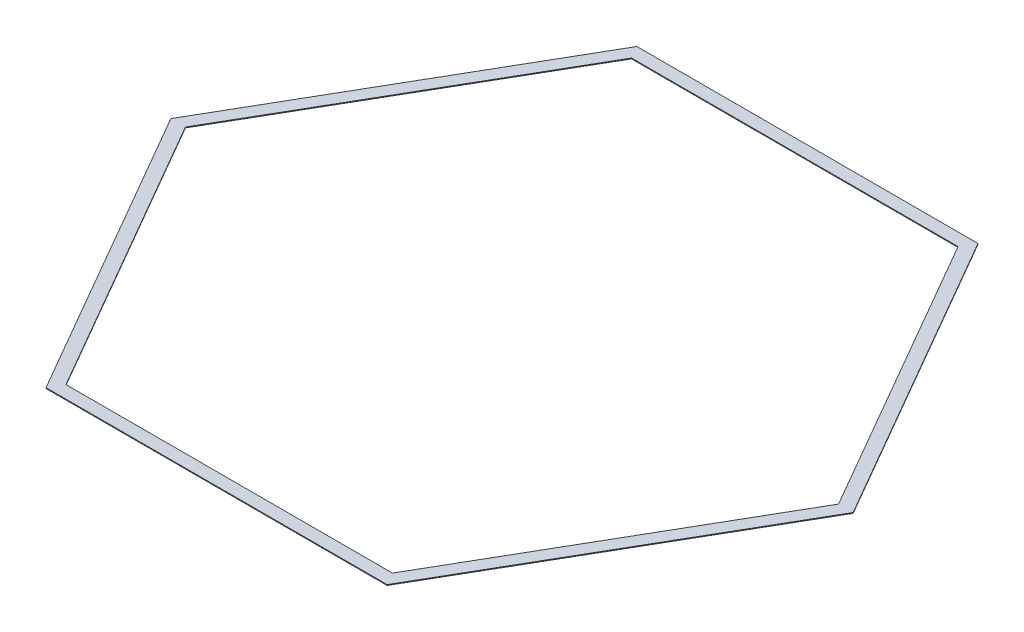
ISO-10303-21;
HEADER;
FILE_DESCRIPTION(('STEP AP214'),'2;1');
FILE_NAME('part.step','',(''),(''),'','','');
FILE_SCHEMA(('AUTOMOTIVE_DESIGN { 1 0 10303 214 1 1 1 1 }'));
ENDSEC;
DATA;
#1=APPLICATION_CONTEXT('core data for automotive mechanical design processes');
#2=APPLICATION_PROTOCOL_DEFINITION('international standard','automotive_design',2000,#1);
#3=PRODUCT_CONTEXT('',#1,'mechanical');
#4=PRODUCT('Part','Part','',(#3));
#5=PRODUCT_RELATED_PRODUCT_CATEGORY('part','',(#4));
#6=PRODUCT_DEFINITION_FORMATION('','',#4);
#7=PRODUCT_DEFINITION_CONTEXT('part definition',#1,'design');
#8=PRODUCT_DEFINITION('design','',#6,#7);
#9=PRODUCT_DEFINITION_SHAPE('','',#8);
#10=(LENGTH_UNIT() NAMED_UNIT(*) SI_UNIT(.MILLI.,.METRE.));
#11=(NAMED_UNIT(*) PLANE_ANGLE_UNIT() SI_UNIT($,.RADIAN.));
#12=(NAMED_UNIT(*) SI_UNIT($,.STERADIAN.) SOLID_ANGLE_UNIT());
#13=UNCERTAINTY_MEASURE_WITH_UNIT(LENGTH_MEASURE(1.E-05),#10,'distance_accuracy_value','');
#14=(GEOMETRIC_REPRESENTATION_CONTEXT(3) GLOBAL_UNCERTAINTY_ASSIGNED_CONTEXT((#13)) GLOBAL_UNIT_ASSIGNED_CONTEXT((#10,
#11,#12)) REPRESENTATION_CONTEXT('',''));
#15=CARTESIAN_POINT('',(0.,0.,0.));
#16=DIRECTION('',(0.,0.,1.));
#17=DIRECTION('',(1.,0.,0.));
#18=AXIS2_PLACEMENT_3D('',#15,#16,#17);
#19=CARTESIAN_POINT('',(0.,3.175,0.));
#20=DIRECTION('',(0.,1.,0.));
#21=DIRECTION('',(0.,0.,1.));
#22=AXIS2_PLACEMENT_3D('',#19,#20,#21);
#23=PLANE('',#22);
#24=DIRECTION('',(-1.,0.,0.));
#25=VECTOR('',#24,1.);
#26=CARTESIAN_POINT('',(685.509319248294,3.175,-1187.33697));
#27=LINE('',#26,#25);
#28=CARTESIAN_POINT('',(685.509319248294,3.175,-1187.33697));
#29=VERTEX_POINT('',#28);
#30=CARTESIAN_POINT('',(-685.509319248295,3.175,-1187.33697));
#31=VERTEX_POINT('',#30);
#32=EDGE_CURVE('E177',#29,#31,#27,.T.);
#33=ORIENTED_EDGE('',*,*,#32,.T.);
#34=DIRECTION('',(-0.5,0.,0.866025403784439));
#35=VECTOR('',#34,1.);
#36=CARTESIAN_POINT('',(-685.509319248295,3.175,-1187.33697));
#37=LINE('',#36,#35);
#38=CARTESIAN_POINT('',(-1371.01863849659,3.175,0.));
#39=VERTEX_POINT('',#38);
#40=EDGE_CURVE('E180',#31,#39,#37,.T.);
#41=ORIENTED_EDGE('',*,*,#40,.T.);
#42=DIRECTION('',(0.5,0.,0.866025403784439));
#43=VECTOR('',#42,1.);
#44=CARTESIAN_POINT('',(-1371.01863849659,3.175,0.));
#45=LINE('',#44,#43);
#46=CARTESIAN_POINT('',(-685.509319248294,3.175,1187.33697));
#47=VERTEX_POINT('',#46);
#48=EDGE_CURVE('E183',#39,#47,#45,.T.);
#49=ORIENTED_EDGE('',*,*,#48,.T.);
#50=DIRECTION('',(1.,0.,0.));
#51=VECTOR('',#50,1.);
#52=CARTESIAN_POINT('',(-685.509319248294,3.175,1187.33697));
#53=LINE('',#52,#51);
#54=CARTESIAN_POINT('',(685.509319248295,3.175,1187.33697));
#55=VERTEX_POINT('',#54);
#56=EDGE_CURVE('E185',#47,#55,#53,.T.);
#57=ORIENTED_EDGE('',*,*,#56,.T.);
#58=DIRECTION('',(0.5,0.,-0.866025403784439));
#59=VECTOR('',#58,1.);
#60=CARTESIAN_POINT('',(685.509319248295,3.175,1187.33697));
#61=LINE('',#60,#59);
#62=CARTESIAN_POINT('',(1371.01863849659,3.175,-3.6429192995513E-13));
#63=VERTEX_POINT('',#62);
#64=EDGE_CURVE('E187',#55,#63,#61,.T.);
#65=ORIENTED_EDGE('',*,*,#64,.T.);
#66=DIRECTION('',(-0.5,0.,-0.866025403784438));
#67=VECTOR('',#66,1.);
#68=CARTESIAN_POINT('',(1371.01863849659,3.175,-3.6429192995513E-13));
#69=LINE('',#68,#67);
#70=EDGE_CURVE('E189',#63,#29,#69,.T.);
#71=ORIENTED_EDGE('',*,*,#70,.T.);
#72=EDGE_LOOP('',(#33,#41,#49,#57,#65,#71));
#73=FACE_BOUND('',#72,.T.);
#74=DIRECTION('',(-0.5,0.,-0.866025403784439));
#75=VECTOR('',#74,1.);
#76=CARTESIAN_POINT('',(1312.35985114692,3.175,-2.21897318819369E-13));
#77=LINE('',#76,#75);
#78=CARTESIAN_POINT('',(1312.35985114692,3.175,-2.21897318819369E-13));
#79=VERTEX_POINT('',#78);
#80=CARTESIAN_POINT('',(656.179925573462,3.175,-1136.53697));
#81=VERTEX_POINT('',#80);
#82=EDGE_CURVE('E134',#79,#81,#77,.T.);
#83=ORIENTED_EDGE('',*,*,#82,.F.);
#84=DIRECTION('',(0.5,0.,-0.866025403784439));
#85=VECTOR('',#84,1.);
#86=CARTESIAN_POINT('',(656.179925573462,3.175,1136.53697));
#87=LINE('',#86,#85);
#88=CARTESIAN_POINT('',(656.179925573462,3.175,1136.53697));
#89=VERTEX_POINT('',#88);
#90=EDGE_CURVE('E126',#89,#79,#87,.T.);
#91=ORIENTED_EDGE('',*,*,#90,.F.);
#92=DIRECTION('',(1.,0.,0.));
#93=VECTOR('',#92,1.);
#94=CARTESIAN_POINT('',(-656.179925573461,3.175,1136.53697));
#95=LINE('',#94,#93);
#96=CARTESIAN_POINT('',(-656.179925573461,3.175,1136.53697));
#97=VERTEX_POINT('',#96);
#98=EDGE_CURVE('E155',#97,#89,#95,.T.);
#99=ORIENTED_EDGE('',*,*,#98,.F.);
#100=DIRECTION('',(0.5,0.,0.866025403784439));
#101=VECTOR('',#100,1.);
#102=CARTESIAN_POINT('',(-1312.35985114692,3.175,0.));
#103=LINE('',#102,#101);
#104=CARTESIAN_POINT('',(-1312.35985114692,3.175,0.));
#105=VERTEX_POINT('',#104);
#106=EDGE_CURVE('E153',#105,#97,#103,.T.);
#107=ORIENTED_EDGE('',*,*,#106,.F.);
#108=DIRECTION('',(-0.5,0.,0.866025403784439));
#109=VECTOR('',#108,1.);
#110=CARTESIAN_POINT('',(-656.179925573462,3.175,-1136.53697));
#111=LINE('',#110,#109);
#112=CARTESIAN_POINT('',(-656.179925573462,3.175,-1136.53697));
#113=VERTEX_POINT('',#112);
#114=EDGE_CURVE('E149',#113,#105,#111,.T.);
#115=ORIENTED_EDGE('',*,*,#114,.F.);
#116=DIRECTION('',(-1.,0.,0.));
#117=VECTOR('',#116,1.);
#118=CARTESIAN_POINT('',(656.179925573462,3.175,-1136.53697));
#119=LINE('',#118,#117);
#120=EDGE_CURVE('E147',#81,#113,#119,.T.);
#121=ORIENTED_EDGE('',*,*,#120,.F.);
#122=EDGE_LOOP('',(#83,#91,#99,#107,#115,#121));
#123=FACE_BOUND('',#122,.T.);
#124=ADVANCED_FACE('F37',(#73,#123),#23,.T.);
#125=CARTESIAN_POINT('',(0.,0.,0.));
#126=DIRECTION('',(0.,1.,0.));
#127=DIRECTION('',(0.,0.,1.));
#128=AXIS2_PLACEMENT_3D('',#125,#126,#127);
#129=PLANE('',#128);
#130=DIRECTION('',(-1.,0.,0.));
#131=VECTOR('',#130,1.);
#132=CARTESIAN_POINT('',(685.509319248294,0.,-1187.33697));
#133=LINE('',#132,#131);
#134=CARTESIAN_POINT('',(685.509319248294,0.,-1187.33697));
#135=VERTEX_POINT('',#134);
#136=CARTESIAN_POINT('',(-685.509319248295,0.,-1187.33697));
#137=VERTEX_POINT('',#136);
#138=EDGE_CURVE('E142',#135,#137,#133,.T.);
#139=ORIENTED_EDGE('',*,*,#138,.F.);
#140=DIRECTION('',(-0.5,0.,-0.866025403784438));
#141=VECTOR('',#140,1.);
#142=CARTESIAN_POINT('',(1371.01863849659,0.,-3.6429192995513E-13));
#143=LINE('',#142,#141);
#144=CARTESIAN_POINT('',(1371.01863849659,0.,-3.6429192995513E-13));
#145=VERTEX_POINT('',#144);
#146=EDGE_CURVE('E181',#145,#135,#143,.T.);
#147=ORIENTED_EDGE('',*,*,#146,.F.);
#148=DIRECTION('',(0.5,0.,-0.866025403784439));
#149=VECTOR('',#148,1.);
#150=CARTESIAN_POINT('',(685.509319248295,0.,1187.33697));
#151=LINE('',#150,#149);
#152=CARTESIAN_POINT('',(685.509319248295,0.,1187.33697));
#153=VERTEX_POINT('',#152);
#154=EDGE_CURVE('E200',#153,#145,#151,.T.);
#155=ORIENTED_EDGE('',*,*,#154,.F.);
#156=DIRECTION('',(1.,0.,0.));
#157=VECTOR('',#156,1.);
#158=CARTESIAN_POINT('',(-685.509319248294,0.,1187.33697));
#159=LINE('',#158,#157);
#160=CARTESIAN_POINT('',(-685.509319248294,0.,1187.33697));
#161=VERTEX_POINT('',#160);
#162=EDGE_CURVE('E198',#161,#153,#159,.T.);
#163=ORIENTED_EDGE('',*,*,#162,.F.);
#164=DIRECTION('',(0.5,0.,0.866025403784439));
#165=VECTOR('',#164,1.);
#166=CARTESIAN_POINT('',(-1371.01863849659,0.,0.));
#167=LINE('',#166,#165);
#168=CARTESIAN_POINT('',(-1371.01863849659,0.,0.));
#169=VERTEX_POINT('',#168);
#170=EDGE_CURVE('E196',#169,#161,#167,.T.);
#171=ORIENTED_EDGE('',*,*,#170,.F.);
#172=DIRECTION('',(-0.5,0.,0.866025403784439));
#173=VECTOR('',#172,1.);
#174=CARTESIAN_POINT('',(-685.509319248295,0.,-1187.33697));
#175=LINE('',#174,#173);
#176=EDGE_CURVE('E194',#137,#169,#175,.T.);
#177=ORIENTED_EDGE('',*,*,#176,.F.);
#178=EDGE_LOOP('',(#139,#147,#155,#163,#171,#177));
#179=FACE_BOUND('',#178,.T.);
#180=DIRECTION('',(0.5,0.,-0.866025403784439));
#181=VECTOR('',#180,1.);
#182=CARTESIAN_POINT('',(656.179925573462,0.,1136.53697));
#183=LINE('',#182,#181);
#184=CARTESIAN_POINT('',(656.179925573462,0.,1136.53697));
#185=VERTEX_POINT('',#184);
#186=CARTESIAN_POINT('',(1312.35985114692,0.,-2.21897318819369E-13));
#187=VERTEX_POINT('',#186);
#188=EDGE_CURVE('E60',#185,#187,#183,.T.);
#189=ORIENTED_EDGE('',*,*,#188,.T.);
#190=DIRECTION('',(-0.5,0.,-0.866025403784439));
#191=VECTOR('',#190,1.);
#192=CARTESIAN_POINT('',(1312.35985114692,0.,-2.21897318819369E-13));
#193=LINE('',#192,#191);
#194=CARTESIAN_POINT('',(656.179925573462,0.,-1136.53697));
#195=VERTEX_POINT('',#194);
#196=EDGE_CURVE('E141',#187,#195,#193,.T.);
#197=ORIENTED_EDGE('',*,*,#196,.T.);
#198=DIRECTION('',(-1.,0.,0.));
#199=VECTOR('',#198,1.);
#200=CARTESIAN_POINT('',(656.179925573462,0.,-1136.53697));
#201=LINE('',#200,#199);
#202=CARTESIAN_POINT('',(-656.179925573462,0.,-1136.53697));
#203=VERTEX_POINT('',#202);
#204=EDGE_CURVE('E159',#195,#203,#201,.T.);
#205=ORIENTED_EDGE('',*,*,#204,.T.);
#206=DIRECTION('',(-0.5,0.,0.866025403784439));
#207=VECTOR('',#206,1.);
#208=CARTESIAN_POINT('',(-656.179925573462,0.,-1136.53697));
#209=LINE('',#208,#207);
#210=CARTESIAN_POINT('',(-1312.35985114692,0.,0.));
#211=VERTEX_POINT('',#210);
#212=EDGE_CURVE('E162',#203,#211,#209,.T.);
#213=ORIENTED_EDGE('',*,*,#212,.T.);
#214=DIRECTION('',(0.5,0.,0.866025403784439));
#215=VECTOR('',#214,1.);
#216=CARTESIAN_POINT('',(-1312.35985114692,0.,0.));
#217=LINE('',#216,#215);
#218=CARTESIAN_POINT('',(-656.179925573461,0.,1136.53697));
#219=VERTEX_POINT('',#218);
#220=EDGE_CURVE('E165',#211,#219,#217,.T.);
#221=ORIENTED_EDGE('',*,*,#220,.T.);
#222=DIRECTION('',(1.,0.,0.));
#223=VECTOR('',#222,1.);
#224=CARTESIAN_POINT('',(-656.179925573461,0.,1136.53697));
#225=LINE('',#224,#223);
#226=EDGE_CURVE('E135',#219,#185,#225,.T.);
#227=ORIENTED_EDGE('',*,*,#226,.T.);
#228=EDGE_LOOP('',(#189,#197,#205,#213,#221,#227));
#229=FACE_BOUND('',#228,.T.);
#230=ADVANCED_FACE('F224',(#179,#229),#129,.F.);
#231=CARTESIAN_POINT('',(685.509319248294,3.175,-1187.33697));
#232=DIRECTION('',(0.,0.,1.));
#233=DIRECTION('',(1.,0.,0.));
#234=AXIS2_PLACEMENT_3D('',#231,#232,#233);
#235=PLANE('',#234);
#236=ORIENTED_EDGE('',*,*,#138,.T.);
#237=DIRECTION('',(0.,-1.,0.));
#238=VECTOR('',#237,1.);
#239=CARTESIAN_POINT('',(-685.509319248295,3.175,-1187.33697));
#240=LINE('',#239,#238);
#241=EDGE_CURVE('E11',#31,#137,#240,.T.);
#242=ORIENTED_EDGE('',*,*,#241,.F.);
#243=ORIENTED_EDGE('',*,*,#32,.F.);
#244=DIRECTION('',(0.,-1.,0.));
#245=VECTOR('',#244,1.);
#246=CARTESIAN_POINT('',(685.509319248294,3.175,-1187.33697));
#247=LINE('',#246,#245);
#248=EDGE_CURVE('E191',#29,#135,#247,.T.);
#249=ORIENTED_EDGE('',*,*,#248,.T.);
#250=EDGE_LOOP('',(#236,#242,#243,#249));
#251=FACE_BOUND('',#250,.T.);
#252=ADVANCED_FACE('F39',(#251),#235,.F.);
#253=CARTESIAN_POINT('',(-685.509319248295,3.175,-1187.33697));
#254=DIRECTION('',(0.866025403784439,0.,0.5));
#255=DIRECTION('',(0.5,0.,-0.866025403784439));
#256=AXIS2_PLACEMENT_3D('',#253,#254,#255);
#257=PLANE('',#256);
#258=ORIENTED_EDGE('',*,*,#176,.T.);
#259=DIRECTION('',(0.,-1.,0.));
#260=VECTOR('',#259,1.);
#261=CARTESIAN_POINT('',(-1371.01863849659,3.175,0.));
#262=LINE('',#261,#260);
#263=EDGE_CURVE('E45',#39,#169,#262,.T.);
#264=ORIENTED_EDGE('',*,*,#263,.F.);
#265=ORIENTED_EDGE('',*,*,#40,.F.);
#266=ORIENTED_EDGE('',*,*,#241,.T.);
#267=EDGE_LOOP('',(#258,#264,#265,#266));
#268=FACE_BOUND('',#267,.T.);
#269=ADVANCED_FACE('F241',(#268),#257,.F.);
#270=CARTESIAN_POINT('',(-1371.01863849659,3.175,0.));
#271=DIRECTION('',(0.866025403784439,0.,-0.5));
#272=DIRECTION('',(-0.5,0.,-0.866025403784439));
#273=AXIS2_PLACEMENT_3D('',#270,#271,#272);
#274=PLANE('',#273);
#275=ORIENTED_EDGE('',*,*,#170,.T.);
#276=DIRECTION('',(0.,-1.,0.));
#277=VECTOR('',#276,1.);
#278=CARTESIAN_POINT('',(-685.509319248294,3.175,1187.33697));
#279=LINE('',#278,#277);
#280=EDGE_CURVE('E211',#47,#161,#279,.T.);
#281=ORIENTED_EDGE('',*,*,#280,.F.);
#282=ORIENTED_EDGE('',*,*,#48,.F.);
#283=ORIENTED_EDGE('',*,*,#263,.T.);
#284=EDGE_LOOP('',(#275,#281,#282,#283));
#285=FACE_BOUND('',#284,.T.);
#286=ADVANCED_FACE('F218',(#285),#274,.F.);
#287=CARTESIAN_POINT('',(-685.509319248294,3.175,1187.33697));
#288=DIRECTION('',(0.,0.,-1.));
#289=DIRECTION('',(-1.,0.,0.));
#290=AXIS2_PLACEMENT_3D('',#287,#288,#289);
#291=PLANE('',#290);
#292=ORIENTED_EDGE('',*,*,#162,.T.);
#293=DIRECTION('',(0.,-1.,0.));
#294=VECTOR('',#293,1.);
#295=CARTESIAN_POINT('',(685.509319248295,3.175,1187.33697));
#296=LINE('',#295,#294);
#297=EDGE_CURVE('E208',#55,#153,#296,.T.);
#298=ORIENTED_EDGE('',*,*,#297,.F.);
#299=ORIENTED_EDGE('',*,*,#56,.F.);
#300=ORIENTED_EDGE('',*,*,#280,.T.);
#301=EDGE_LOOP('',(#292,#298,#299,#300));
#302=FACE_BOUND('',#301,.T.);
#303=ADVANCED_FACE('F230',(#302),#291,.F.);
#304=CARTESIAN_POINT('',(685.509319248295,3.175,1187.33697));
#305=DIRECTION('',(-0.866025403784439,0.,-0.5));
#306=DIRECTION('',(-0.5,0.,0.866025403784439));
#307=AXIS2_PLACEMENT_3D('',#304,#305,#306);
#308=PLANE('',#307);
#309=ORIENTED_EDGE('',*,*,#154,.T.);
#310=DIRECTION('',(0.,-1.,0.));
#311=VECTOR('',#310,1.);
#312=CARTESIAN_POINT('',(1371.01863849659,3.175,-3.6429192995513E-13));
#313=LINE('',#312,#311);
#314=EDGE_CURVE('E205',#63,#145,#313,.T.);
#315=ORIENTED_EDGE('',*,*,#314,.F.);
#316=ORIENTED_EDGE('',*,*,#64,.F.);
#317=ORIENTED_EDGE('',*,*,#297,.T.);
#318=EDGE_LOOP('',(#309,#315,#316,#317));
#319=FACE_BOUND('',#318,.T.);
#320=ADVANCED_FACE('F234',(#319),#308,.F.);
#321=CARTESIAN_POINT('',(1371.01863849659,3.175,-3.6429192995513E-13));
#322=DIRECTION('',(-0.866025403784438,0.,0.5));
#323=DIRECTION('',(0.5,0.,0.866025403784438));
#324=AXIS2_PLACEMENT_3D('',#321,#322,#323);
#325=PLANE('',#324);
#326=ORIENTED_EDGE('',*,*,#146,.T.);
#327=ORIENTED_EDGE('',*,*,#248,.F.);
#328=ORIENTED_EDGE('',*,*,#70,.F.);
#329=ORIENTED_EDGE('',*,*,#314,.T.);
#330=EDGE_LOOP('',(#326,#327,#328,#329));
#331=FACE_BOUND('',#330,.T.);
#332=ADVANCED_FACE('F244',(#331),#325,.F.);
#333=CARTESIAN_POINT('',(656.179925573462,3.175,1136.53697));
#334=DIRECTION('',(-0.866025403784439,0.,-0.5));
#335=DIRECTION('',(-0.5,0.,0.866025403784439));
#336=AXIS2_PLACEMENT_3D('',#333,#334,#335);
#337=PLANE('',#336);
#338=ORIENTED_EDGE('',*,*,#188,.F.);
#339=DIRECTION('',(0.,-1.,0.));
#340=VECTOR('',#339,1.);
#341=CARTESIAN_POINT('',(656.179925573462,3.175,1136.53697));
#342=LINE('',#341,#340);
#343=EDGE_CURVE('E130',#89,#185,#342,.T.);
#344=ORIENTED_EDGE('',*,*,#343,.F.);
#345=ORIENTED_EDGE('',*,*,#90,.T.);
#346=DIRECTION('',(0.,-1.,0.));
#347=VECTOR('',#346,1.);
#348=CARTESIAN_POINT('',(1312.35985114692,3.175,-2.21897318819369E-13));
#349=LINE('',#348,#347);
#350=EDGE_CURVE('E129',#79,#187,#349,.T.);
#351=ORIENTED_EDGE('',*,*,#350,.T.);
#352=EDGE_LOOP('',(#338,#344,#345,#351));
#353=FACE_BOUND('',#352,.T.);
#354=ADVANCED_FACE('F128',(#353),#337,.T.);
#355=CARTESIAN_POINT('',(1312.35985114692,3.175,-2.21897318819369E-13));
#356=DIRECTION('',(-0.866025403784439,0.,0.5));
#357=DIRECTION('',(0.5,0.,0.866025403784439));
#358=AXIS2_PLACEMENT_3D('',#355,#356,#357);
#359=PLANE('',#358);
#360=ORIENTED_EDGE('',*,*,#196,.F.);
#361=ORIENTED_EDGE('',*,*,#350,.F.);
#362=ORIENTED_EDGE('',*,*,#82,.T.);
#363=DIRECTION('',(0.,-1.,0.));
#364=VECTOR('',#363,1.);
#365=CARTESIAN_POINT('',(656.179925573462,3.175,-1136.53697));
#366=LINE('',#365,#364);
#367=EDGE_CURVE('E143',#81,#195,#366,.T.);
#368=ORIENTED_EDGE('',*,*,#367,.T.);
#369=EDGE_LOOP('',(#360,#361,#362,#368));
#370=FACE_BOUND('',#369,.T.);
#371=ADVANCED_FACE('F138',(#370),#359,.T.);
#372=CARTESIAN_POINT('',(656.179925573462,3.175,-1136.53697));
#373=DIRECTION('',(0.,0.,1.));
#374=DIRECTION('',(1.,0.,0.));
#375=AXIS2_PLACEMENT_3D('',#372,#373,#374);
#376=PLANE('',#375);
#377=ORIENTED_EDGE('',*,*,#204,.F.);
#378=ORIENTED_EDGE('',*,*,#367,.F.);
#379=ORIENTED_EDGE('',*,*,#120,.T.);
#380=DIRECTION('',(0.,-1.,0.));
#381=VECTOR('',#380,1.);
#382=CARTESIAN_POINT('',(-656.179925573462,3.175,-1136.53697));
#383=LINE('',#382,#381);
#384=EDGE_CURVE('E174',#113,#203,#383,.T.);
#385=ORIENTED_EDGE('',*,*,#384,.T.);
#386=EDGE_LOOP('',(#377,#378,#379,#385));
#387=FACE_BOUND('',#386,.T.);
#388=ADVANCED_FACE('F262',(#387),#376,.T.);
#389=CARTESIAN_POINT('',(-656.179925573462,3.175,-1136.53697));
#390=DIRECTION('',(0.866025403784439,0.,0.5));
#391=DIRECTION('',(0.5,0.,-0.866025403784439));
#392=AXIS2_PLACEMENT_3D('',#389,#390,#391);
#393=PLANE('',#392);
#394=ORIENTED_EDGE('',*,*,#212,.F.);
#395=ORIENTED_EDGE('',*,*,#384,.F.);
#396=ORIENTED_EDGE('',*,*,#114,.T.);
#397=DIRECTION('',(0.,-1.,0.));
#398=VECTOR('',#397,1.);
#399=CARTESIAN_POINT('',(-1312.35985114692,3.175,0.));
#400=LINE('',#399,#398);
#401=EDGE_CURVE('E172',#105,#211,#400,.T.);
#402=ORIENTED_EDGE('',*,*,#401,.T.);
#403=EDGE_LOOP('',(#394,#395,#396,#402));
#404=FACE_BOUND('',#403,.T.);
#405=ADVANCED_FACE('F265',(#404),#393,.T.);
#406=CARTESIAN_POINT('',(-1312.35985114692,3.175,0.));
#407=DIRECTION('',(0.866025403784439,0.,-0.5));
#408=DIRECTION('',(-0.5,0.,-0.866025403784439));
#409=AXIS2_PLACEMENT_3D('',#406,#407,#408);
#410=PLANE('',#409);
#411=ORIENTED_EDGE('',*,*,#220,.F.);
#412=ORIENTED_EDGE('',*,*,#401,.F.);
#413=ORIENTED_EDGE('',*,*,#106,.T.);
#414=DIRECTION('',(0.,-1.,0.));
#415=VECTOR('',#414,1.);
#416=CARTESIAN_POINT('',(-656.179925573461,3.175,1136.53697));
#417=LINE('',#416,#415);
#418=EDGE_CURVE('E52',#97,#219,#417,.T.);
#419=ORIENTED_EDGE('',*,*,#418,.T.);
#420=EDGE_LOOP('',(#411,#412,#413,#419));
#421=FACE_BOUND('',#420,.T.);
#422=ADVANCED_FACE('F269',(#421),#410,.T.);
#423=CARTESIAN_POINT('',(-656.179925573461,3.175,1136.53697));
#424=DIRECTION('',(0.,0.,-1.));
#425=DIRECTION('',(-1.,0.,0.));
#426=AXIS2_PLACEMENT_3D('',#423,#424,#425);
#427=PLANE('',#426);
#428=ORIENTED_EDGE('',*,*,#226,.F.);
#429=ORIENTED_EDGE('',*,*,#418,.F.);
#430=ORIENTED_EDGE('',*,*,#98,.T.);
#431=ORIENTED_EDGE('',*,*,#343,.T.);
#432=EDGE_LOOP('',(#428,#429,#430,#431));
#433=FACE_BOUND('',#432,.T.);
#434=ADVANCED_FACE('F273',(#433),#427,.T.);
#435=CLOSED_SHELL('',(#124,#230,#252,#269,#286,#303,#320,#332,#354,#371,#388,#405,#422,#434));
#436=MANIFOLD_SOLID_BREP('B2',#435);
#437=ADVANCED_BREP_SHAPE_REPRESENTATION('',(#18,#436),#14);
#438=SHAPE_DEFINITION_REPRESENTATION(#9,#437);
ENDSEC;
END-ISO-10303-21;
